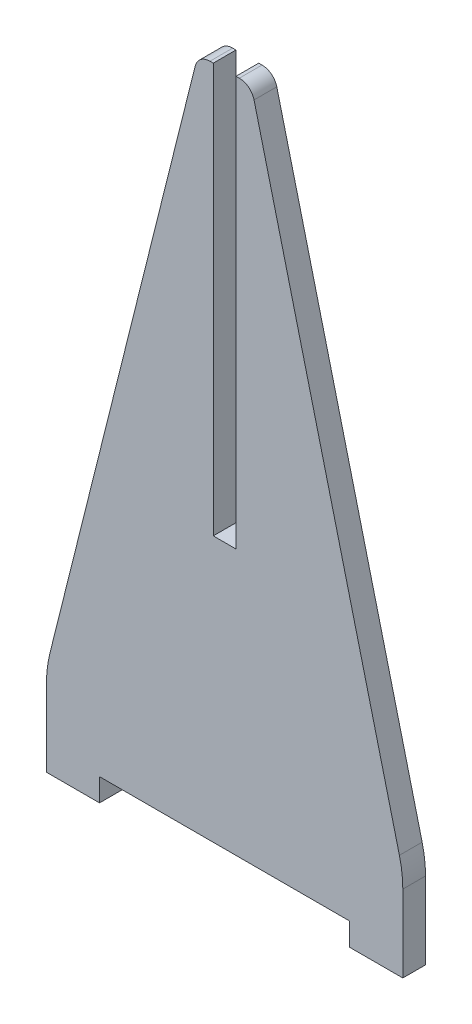
ISO-10303-21;
HEADER;
FILE_DESCRIPTION(('STEP AP214'),'2;1');
FILE_NAME('part.step','',(''),(''),'','','');
FILE_SCHEMA(('AUTOMOTIVE_DESIGN { 1 0 10303 214 1 1 1 1 }'));
ENDSEC;
DATA;
#1=APPLICATION_CONTEXT('core data for automotive mechanical design processes');
#2=APPLICATION_PROTOCOL_DEFINITION('international standard','automotive_design',2000,#1);
#3=PRODUCT_CONTEXT('',#1,'mechanical');
#4=PRODUCT('Part','Part','',(#3));
#5=PRODUCT_RELATED_PRODUCT_CATEGORY('part','',(#4));
#6=PRODUCT_DEFINITION_FORMATION('','',#4);
#7=PRODUCT_DEFINITION_CONTEXT('part definition',#1,'design');
#8=PRODUCT_DEFINITION('design','',#6,#7);
#9=PRODUCT_DEFINITION_SHAPE('','',#8);
#10=(LENGTH_UNIT() NAMED_UNIT(*) SI_UNIT(.MILLI.,.METRE.));
#11=(NAMED_UNIT(*) PLANE_ANGLE_UNIT() SI_UNIT($,.RADIAN.));
#12=(NAMED_UNIT(*) SI_UNIT($,.STERADIAN.) SOLID_ANGLE_UNIT());
#13=UNCERTAINTY_MEASURE_WITH_UNIT(LENGTH_MEASURE(1.E-05),#10,'distance_accuracy_value','');
#14=(GEOMETRIC_REPRESENTATION_CONTEXT(3) GLOBAL_UNCERTAINTY_ASSIGNED_CONTEXT((#13)) GLOBAL_UNIT_ASSIGNED_CONTEXT((#10,
#11,#12)) REPRESENTATION_CONTEXT('',''));
#15=CARTESIAN_POINT('',(0.,0.,0.));
#16=DIRECTION('',(0.,0.,1.));
#17=DIRECTION('',(1.,0.,0.));
#18=AXIS2_PLACEMENT_3D('',#15,#16,#17);
#19=CARTESIAN_POINT('',(23.5,0.,3.));
#20=DIRECTION('',(-1.,0.,0.));
#21=DIRECTION('',(0.,0.,1.));
#22=AXIS2_PLACEMENT_3D('',#19,#20,#21);
#23=PLANE('',#22);
#24=DIRECTION('',(0.,1.,0.));
#25=VECTOR('',#24,1.);
#26=CARTESIAN_POINT('',(23.5,0.,0.));
#27=LINE('',#26,#25);
#28=CARTESIAN_POINT('',(23.5,0.,0.));
#29=VERTEX_POINT('',#28);
#30=CARTESIAN_POINT('',(23.5,10.1534156157351,0.));
#31=VERTEX_POINT('',#30);
#32=EDGE_CURVE('E210',#29,#31,#27,.T.);
#33=ORIENTED_EDGE('',*,*,#32,.T.);
#34=DIRECTION('',(0.,0.,-1.));
#35=VECTOR('',#34,1.);
#36=CARTESIAN_POINT('',(23.5,10.1534156157351,3.));
#37=LINE('',#36,#35);
#38=CARTESIAN_POINT('',(23.5,10.1534156157351,3.));
#39=VERTEX_POINT('',#38);
#40=EDGE_CURVE('E271',#31,#39,#37,.F.);
#41=ORIENTED_EDGE('',*,*,#40,.T.);
#42=DIRECTION('',(0.,1.,0.));
#43=VECTOR('',#42,1.);
#44=CARTESIAN_POINT('',(23.5,0.,3.));
#45=LINE('',#44,#43);
#46=CARTESIAN_POINT('',(23.5,0.,3.));
#47=VERTEX_POINT('',#46);
#48=EDGE_CURVE('E239',#47,#39,#45,.T.);
#49=ORIENTED_EDGE('',*,*,#48,.F.);
#50=DIRECTION('',(0.,0.,-1.));
#51=VECTOR('',#50,1.);
#52=CARTESIAN_POINT('',(23.5,0.,3.));
#53=LINE('',#52,#51);
#54=EDGE_CURVE('E209',#47,#29,#53,.T.);
#55=ORIENTED_EDGE('',*,*,#54,.T.);
#56=EDGE_LOOP('',(#33,#41,#49,#55));
#57=FACE_BOUND('',#56,.T.);
#58=ADVANCED_FACE('F39',(#57),#23,.F.);
#59=CARTESIAN_POINT('',(23.5,12.,3.));
#60=DIRECTION('',(-0.970142500145332,-0.242535625036333,0.));
#61=DIRECTION('',(0.242535625036333,-0.970142500145332,0.));
#62=AXIS2_PLACEMENT_3D('',#59,#60,#61);
#63=PLANE('',#62);
#64=DIRECTION('',(-0.242535625036333,0.970142500145332,0.));
#65=VECTOR('',#64,1.);
#66=CARTESIAN_POINT('',(23.5,12.,0.));
#67=LINE('',#66,#65);
#68=CARTESIAN_POINT('',(23.05213750218,13.7914499912801,0.));
#69=VERTEX_POINT('',#68);
#70=CARTESIAN_POINT('',(3.87873218748184,90.4850712500726,0.));
#71=VERTEX_POINT('',#70);
#72=EDGE_CURVE('E213',#69,#71,#67,.T.);
#73=ORIENTED_EDGE('',*,*,#72,.T.);
#74=DIRECTION('',(0.,0.,-1.));
#75=VECTOR('',#74,1.);
#76=CARTESIAN_POINT('',(3.87873218748183,90.4850712500727,3.));
#77=LINE('',#76,#75);
#78=CARTESIAN_POINT('',(3.87873218748184,90.4850712500726,3.));
#79=VERTEX_POINT('',#78);
#80=EDGE_CURVE('E11',#71,#79,#77,.F.);
#81=ORIENTED_EDGE('',*,*,#80,.T.);
#82=DIRECTION('',(-0.242535625036333,0.970142500145332,0.));
#83=VECTOR('',#82,1.);
#84=CARTESIAN_POINT('',(23.5,12.,3.));
#85=LINE('',#84,#83);
#86=CARTESIAN_POINT('',(23.05213750218,13.7914499912801,3.));
#87=VERTEX_POINT('',#86);
#88=EDGE_CURVE('E171',#87,#79,#85,.T.);
#89=ORIENTED_EDGE('',*,*,#88,.F.);
#90=DIRECTION('',(0.,0.,-1.));
#91=VECTOR('',#90,1.);
#92=CARTESIAN_POINT('',(23.05213750218,13.7914499912801,3.));
#93=LINE('',#92,#91);
#94=EDGE_CURVE('E180',#87,#69,#93,.T.);
#95=ORIENTED_EDGE('',*,*,#94,.T.);
#96=EDGE_LOOP('',(#73,#81,#89,#95));
#97=FACE_BOUND('',#96,.T.);
#98=ADVANCED_FACE('F368',(#97),#63,.F.);
#99=CARTESIAN_POINT('',(1.5,92.,3.));
#100=DIRECTION('',(0.,-1.,0.));
#101=DIRECTION('',(0.,0.,-1.));
#102=AXIS2_PLACEMENT_3D('',#99,#100,#101);
#103=PLANE('',#102);
#104=DIRECTION('',(-1.,0.,0.));
#105=VECTOR('',#104,1.);
#106=CARTESIAN_POINT('',(1.5,92.,3.));
#107=LINE('',#106,#105);
#108=CARTESIAN_POINT('',(1.93844718719117,92.,3.));
#109=VERTEX_POINT('',#108);
#110=CARTESIAN_POINT('',(1.5,92.,3.));
#111=VERTEX_POINT('',#110);
#112=EDGE_CURVE('E161',#109,#111,#107,.T.);
#113=ORIENTED_EDGE('',*,*,#112,.F.);
#114=DIRECTION('',(0.,0.,-1.));
#115=VECTOR('',#114,1.);
#116=CARTESIAN_POINT('',(1.93844718719117,92.,3.));
#117=LINE('',#116,#115);
#118=CARTESIAN_POINT('',(1.93844718719117,92.,0.));
#119=VERTEX_POINT('',#118);
#120=EDGE_CURVE('E47',#109,#119,#117,.T.);
#121=ORIENTED_EDGE('',*,*,#120,.T.);
#122=DIRECTION('',(-1.,0.,0.));
#123=VECTOR('',#122,1.);
#124=CARTESIAN_POINT('',(1.5,92.,0.));
#125=LINE('',#124,#123);
#126=CARTESIAN_POINT('',(1.5,92.,0.));
#127=VERTEX_POINT('',#126);
#128=EDGE_CURVE('E177',#119,#127,#125,.T.);
#129=ORIENTED_EDGE('',*,*,#128,.T.);
#130=DIRECTION('',(0.,0.,-1.));
#131=VECTOR('',#130,1.);
#132=CARTESIAN_POINT('',(1.5,92.,3.));
#133=LINE('',#132,#131);
#134=EDGE_CURVE('E174',#111,#127,#133,.T.);
#135=ORIENTED_EDGE('',*,*,#134,.F.);
#136=EDGE_LOOP('',(#113,#121,#129,#135));
#137=FACE_BOUND('',#136,.T.);
#138=ADVANCED_FACE('F175',(#137),#103,.F.);
#139=CARTESIAN_POINT('',(1.5,38.,3.));
#140=DIRECTION('',(1.,0.,0.));
#141=DIRECTION('',(0.,0.,-1.));
#142=AXIS2_PLACEMENT_3D('',#139,#140,#141);
#143=PLANE('',#142);
#144=DIRECTION('',(0.,-1.,0.));
#145=VECTOR('',#144,1.);
#146=CARTESIAN_POINT('',(1.5,38.,0.));
#147=LINE('',#146,#145);
#148=CARTESIAN_POINT('',(1.5,38.,0.));
#149=VERTEX_POINT('',#148);
#150=EDGE_CURVE('E216',#127,#149,#147,.T.);
#151=ORIENTED_EDGE('',*,*,#150,.T.);
#152=DIRECTION('',(0.,0.,-1.));
#153=VECTOR('',#152,1.);
#154=CARTESIAN_POINT('',(1.5,38.,3.));
#155=LINE('',#154,#153);
#156=CARTESIAN_POINT('',(1.5,38.,3.));
#157=VERTEX_POINT('',#156);
#158=EDGE_CURVE('E181',#157,#149,#155,.T.);
#159=ORIENTED_EDGE('',*,*,#158,.F.);
#160=DIRECTION('',(0.,-1.,0.));
#161=VECTOR('',#160,1.);
#162=CARTESIAN_POINT('',(1.5,38.,3.));
#163=LINE('',#162,#161);
#164=EDGE_CURVE('E166',#111,#157,#163,.T.);
#165=ORIENTED_EDGE('',*,*,#164,.F.);
#166=ORIENTED_EDGE('',*,*,#134,.T.);
#167=EDGE_LOOP('',(#151,#159,#165,#166));
#168=FACE_BOUND('',#167,.T.);
#169=ADVANCED_FACE('F183',(#168),#143,.F.);
#170=CARTESIAN_POINT('',(-1.5,38.,3.));
#171=DIRECTION('',(0.,-1.,0.));
#172=DIRECTION('',(0.,0.,-1.));
#173=AXIS2_PLACEMENT_3D('',#170,#171,#172);
#174=PLANE('',#173);
#175=DIRECTION('',(-1.,0.,0.));
#176=VECTOR('',#175,1.);
#177=CARTESIAN_POINT('',(-1.5,38.,0.));
#178=LINE('',#177,#176);
#179=CARTESIAN_POINT('',(-1.5,38.,0.));
#180=VERTEX_POINT('',#179);
#181=EDGE_CURVE('E218',#149,#180,#178,.T.);
#182=ORIENTED_EDGE('',*,*,#181,.T.);
#183=DIRECTION('',(0.,0.,-1.));
#184=VECTOR('',#183,1.);
#185=CARTESIAN_POINT('',(-1.5,38.,3.));
#186=LINE('',#185,#184);
#187=CARTESIAN_POINT('',(-1.5,38.,3.));
#188=VERTEX_POINT('',#187);
#189=EDGE_CURVE('E260',#188,#180,#186,.T.);
#190=ORIENTED_EDGE('',*,*,#189,.F.);
#191=DIRECTION('',(-1.,0.,0.));
#192=VECTOR('',#191,1.);
#193=CARTESIAN_POINT('',(-1.5,38.,3.));
#194=LINE('',#193,#192);
#195=EDGE_CURVE('E186',#157,#188,#194,.T.);
#196=ORIENTED_EDGE('',*,*,#195,.F.);
#197=ORIENTED_EDGE('',*,*,#158,.T.);
#198=EDGE_LOOP('',(#182,#190,#196,#197));
#199=FACE_BOUND('',#198,.T.);
#200=ADVANCED_FACE('F302',(#199),#174,.F.);
#201=CARTESIAN_POINT('',(-1.5,38.,3.));
#202=DIRECTION('',(-1.,0.,0.));
#203=DIRECTION('',(0.,-1.,0.));
#204=AXIS2_PLACEMENT_3D('',#201,#202,#203);
#205=PLANE('',#204);
#206=DIRECTION('',(0.,1.,0.));
#207=VECTOR('',#206,1.);
#208=CARTESIAN_POINT('',(-1.5,38.,0.));
#209=LINE('',#208,#207);
#210=CARTESIAN_POINT('',(-1.5,92.,0.));
#211=VERTEX_POINT('',#210);
#212=EDGE_CURVE('E220',#180,#211,#209,.T.);
#213=ORIENTED_EDGE('',*,*,#212,.T.);
#214=DIRECTION('',(0.,0.,-1.));
#215=VECTOR('',#214,1.);
#216=CARTESIAN_POINT('',(-1.5,92.,3.));
#217=LINE('',#216,#215);
#218=CARTESIAN_POINT('',(-1.5,92.,3.));
#219=VERTEX_POINT('',#218);
#220=EDGE_CURVE('E257',#219,#211,#217,.T.);
#221=ORIENTED_EDGE('',*,*,#220,.F.);
#222=DIRECTION('',(0.,1.,0.));
#223=VECTOR('',#222,1.);
#224=CARTESIAN_POINT('',(-1.5,38.,3.));
#225=LINE('',#224,#223);
#226=EDGE_CURVE('E188',#188,#219,#225,.T.);
#227=ORIENTED_EDGE('',*,*,#226,.F.);
#228=ORIENTED_EDGE('',*,*,#189,.T.);
#229=EDGE_LOOP('',(#213,#221,#227,#228));
#230=FACE_BOUND('',#229,.T.);
#231=ADVANCED_FACE('F309',(#230),#205,.F.);
#232=CARTESIAN_POINT('',(-3.5,92.,3.));
#233=DIRECTION('',(0.,-1.,0.));
#234=DIRECTION('',(0.,0.,-1.));
#235=AXIS2_PLACEMENT_3D('',#232,#233,#234);
#236=PLANE('',#235);
#237=DIRECTION('',(-1.,0.,0.));
#238=VECTOR('',#237,1.);
#239=CARTESIAN_POINT('',(-3.5,92.,0.));
#240=LINE('',#239,#238);
#241=CARTESIAN_POINT('',(-1.93844718719117,92.,0.));
#242=VERTEX_POINT('',#241);
#243=EDGE_CURVE('E222',#211,#242,#240,.T.);
#244=ORIENTED_EDGE('',*,*,#243,.T.);
#245=DIRECTION('',(0.,0.,-1.));
#246=VECTOR('',#245,1.);
#247=CARTESIAN_POINT('',(-1.93844718719117,92.,3.));
#248=LINE('',#247,#246);
#249=CARTESIAN_POINT('',(-1.93844718719117,92.,3.));
#250=VERTEX_POINT('',#249);
#251=EDGE_CURVE('E290',#242,#250,#248,.F.);
#252=ORIENTED_EDGE('',*,*,#251,.T.);
#253=DIRECTION('',(-1.,0.,0.));
#254=VECTOR('',#253,1.);
#255=CARTESIAN_POINT('',(-3.5,92.,3.));
#256=LINE('',#255,#254);
#257=EDGE_CURVE('E193',#219,#250,#256,.T.);
#258=ORIENTED_EDGE('',*,*,#257,.F.);
#259=ORIENTED_EDGE('',*,*,#220,.T.);
#260=EDGE_LOOP('',(#244,#252,#258,#259));
#261=FACE_BOUND('',#260,.T.);
#262=ADVANCED_FACE('F312',(#261),#236,.F.);
#263=CARTESIAN_POINT('',(-23.5,12.,3.));
#264=DIRECTION('',(0.970142500145332,-0.242535625036333,0.));
#265=DIRECTION('',(0.242535625036333,0.970142500145332,0.));
#266=AXIS2_PLACEMENT_3D('',#263,#264,#265);
#267=PLANE('',#266);
#268=DIRECTION('',(-0.242535625036333,-0.970142500145332,0.));
#269=VECTOR('',#268,1.);
#270=CARTESIAN_POINT('',(-23.5,12.,3.));
#271=LINE('',#270,#269);
#272=CARTESIAN_POINT('',(-3.87873218748184,90.4850712500726,3.));
#273=VERTEX_POINT('',#272);
#274=CARTESIAN_POINT('',(-23.05213750218,13.7914499912801,3.));
#275=VERTEX_POINT('',#274);
#276=EDGE_CURVE('E195',#273,#275,#271,.T.);
#277=ORIENTED_EDGE('',*,*,#276,.F.);
#278=DIRECTION('',(0.,0.,-1.));
#279=VECTOR('',#278,1.);
#280=CARTESIAN_POINT('',(-3.87873218748183,90.4850712500727,3.));
#281=LINE('',#280,#279);
#282=CARTESIAN_POINT('',(-3.87873218748184,90.4850712500726,0.));
#283=VERTEX_POINT('',#282);
#284=EDGE_CURVE('E283',#273,#283,#281,.T.);
#285=ORIENTED_EDGE('',*,*,#284,.T.);
#286=DIRECTION('',(-0.242535625036333,-0.970142500145332,0.));
#287=VECTOR('',#286,1.);
#288=CARTESIAN_POINT('',(-23.5,12.,0.));
#289=LINE('',#288,#287);
#290=CARTESIAN_POINT('',(-23.05213750218,13.7914499912801,0.));
#291=VERTEX_POINT('',#290);
#292=EDGE_CURVE('E225',#283,#291,#289,.T.);
#293=ORIENTED_EDGE('',*,*,#292,.T.);
#294=DIRECTION('',(0.,0.,-1.));
#295=VECTOR('',#294,1.);
#296=CARTESIAN_POINT('',(-23.05213750218,13.7914499912801,3.));
#297=LINE('',#296,#295);
#298=EDGE_CURVE('E280',#291,#275,#297,.F.);
#299=ORIENTED_EDGE('',*,*,#298,.T.);
#300=EDGE_LOOP('',(#277,#285,#293,#299));
#301=FACE_BOUND('',#300,.T.);
#302=ADVANCED_FACE('F319',(#301),#267,.F.);
#303=CARTESIAN_POINT('',(-23.5,0.,3.));
#304=DIRECTION('',(1.,0.,0.));
#305=DIRECTION('',(0.,0.,-1.));
#306=AXIS2_PLACEMENT_3D('',#303,#304,#305);
#307=PLANE('',#306);
#308=DIRECTION('',(0.,-1.,0.));
#309=VECTOR('',#308,1.);
#310=CARTESIAN_POINT('',(-23.5,0.,3.));
#311=LINE('',#310,#309);
#312=CARTESIAN_POINT('',(-23.5,10.1534156157351,3.));
#313=VERTEX_POINT('',#312);
#314=CARTESIAN_POINT('',(-23.5,0.,3.));
#315=VERTEX_POINT('',#314);
#316=EDGE_CURVE('E197',#313,#315,#311,.T.);
#317=ORIENTED_EDGE('',*,*,#316,.F.);
#318=DIRECTION('',(0.,0.,-1.));
#319=VECTOR('',#318,1.);
#320=CARTESIAN_POINT('',(-23.5,10.1534156157351,3.));
#321=LINE('',#320,#319);
#322=CARTESIAN_POINT('',(-23.5,10.1534156157351,0.));
#323=VERTEX_POINT('',#322);
#324=EDGE_CURVE('E277',#313,#323,#321,.T.);
#325=ORIENTED_EDGE('',*,*,#324,.T.);
#326=DIRECTION('',(0.,-1.,0.));
#327=VECTOR('',#326,1.);
#328=CARTESIAN_POINT('',(-23.5,0.,0.));
#329=LINE('',#328,#327);
#330=CARTESIAN_POINT('',(-23.5,0.,0.));
#331=VERTEX_POINT('',#330);
#332=EDGE_CURVE('E227',#323,#331,#329,.T.);
#333=ORIENTED_EDGE('',*,*,#332,.T.);
#334=DIRECTION('',(0.,0.,-1.));
#335=VECTOR('',#334,1.);
#336=CARTESIAN_POINT('',(-23.5,0.,3.));
#337=LINE('',#336,#335);
#338=EDGE_CURVE('E254',#315,#331,#337,.T.);
#339=ORIENTED_EDGE('',*,*,#338,.F.);
#340=EDGE_LOOP('',(#317,#325,#333,#339));
#341=FACE_BOUND('',#340,.T.);
#342=ADVANCED_FACE('F328',(#341),#307,.F.);
#343=CARTESIAN_POINT('',(-23.5,0.,3.));
#344=DIRECTION('',(0.,1.,0.));
#345=DIRECTION('',(0.,0.,1.));
#346=AXIS2_PLACEMENT_3D('',#343,#344,#345);
#347=PLANE('',#346);
#348=DIRECTION('',(1.,0.,0.));
#349=VECTOR('',#348,1.);
#350=CARTESIAN_POINT('',(-23.5,0.,0.));
#351=LINE('',#350,#349);
#352=CARTESIAN_POINT('',(-16.5,0.,0.));
#353=VERTEX_POINT('',#352);
#354=EDGE_CURVE('E229',#331,#353,#351,.T.);
#355=ORIENTED_EDGE('',*,*,#354,.T.);
#356=DIRECTION('',(0.,0.,-1.));
#357=VECTOR('',#356,1.);
#358=CARTESIAN_POINT('',(-16.5,0.,3.));
#359=LINE('',#358,#357);
#360=CARTESIAN_POINT('',(-16.5,0.,3.));
#361=VERTEX_POINT('',#360);
#362=EDGE_CURVE('E251',#361,#353,#359,.T.);
#363=ORIENTED_EDGE('',*,*,#362,.F.);
#364=DIRECTION('',(1.,0.,0.));
#365=VECTOR('',#364,1.);
#366=CARTESIAN_POINT('',(-23.5,0.,3.));
#367=LINE('',#366,#365);
#368=EDGE_CURVE('E199',#315,#361,#367,.T.);
#369=ORIENTED_EDGE('',*,*,#368,.F.);
#370=ORIENTED_EDGE('',*,*,#338,.T.);
#371=EDGE_LOOP('',(#355,#363,#369,#370));
#372=FACE_BOUND('',#371,.T.);
#373=ADVANCED_FACE('F334',(#372),#347,.F.);
#374=CARTESIAN_POINT('',(-16.5,0.,3.));
#375=DIRECTION('',(-1.,0.,0.));
#376=DIRECTION('',(0.,0.,1.));
#377=AXIS2_PLACEMENT_3D('',#374,#375,#376);
#378=PLANE('',#377);
#379=DIRECTION('',(0.,1.,0.));
#380=VECTOR('',#379,1.);
#381=CARTESIAN_POINT('',(-16.5,0.,0.));
#382=LINE('',#381,#380);
#383=CARTESIAN_POINT('',(-16.5,3.,0.));
#384=VERTEX_POINT('',#383);
#385=EDGE_CURVE('E231',#353,#384,#382,.T.);
#386=ORIENTED_EDGE('',*,*,#385,.T.);
#387=DIRECTION('',(0.,0.,-1.));
#388=VECTOR('',#387,1.);
#389=CARTESIAN_POINT('',(-16.5,3.,3.));
#390=LINE('',#389,#388);
#391=CARTESIAN_POINT('',(-16.5,3.,3.));
#392=VERTEX_POINT('',#391);
#393=EDGE_CURVE('E248',#392,#384,#390,.T.);
#394=ORIENTED_EDGE('',*,*,#393,.F.);
#395=DIRECTION('',(0.,1.,0.));
#396=VECTOR('',#395,1.);
#397=CARTESIAN_POINT('',(-16.5,0.,3.));
#398=LINE('',#397,#396);
#399=EDGE_CURVE('E201',#361,#392,#398,.T.);
#400=ORIENTED_EDGE('',*,*,#399,.F.);
#401=ORIENTED_EDGE('',*,*,#362,.T.);
#402=EDGE_LOOP('',(#386,#394,#400,#401));
#403=FACE_BOUND('',#402,.T.);
#404=ADVANCED_FACE('F340',(#403),#378,.F.);
#405=CARTESIAN_POINT('',(-16.5,3.,3.));
#406=DIRECTION('',(0.,1.,0.));
#407=DIRECTION('',(0.,0.,1.));
#408=AXIS2_PLACEMENT_3D('',#405,#406,#407);
#409=PLANE('',#408);
#410=DIRECTION('',(1.,0.,0.));
#411=VECTOR('',#410,1.);
#412=CARTESIAN_POINT('',(-16.5,3.,0.));
#413=LINE('',#412,#411);
#414=CARTESIAN_POINT('',(16.5,3.,0.));
#415=VERTEX_POINT('',#414);
#416=EDGE_CURVE('E233',#384,#415,#413,.T.);
#417=ORIENTED_EDGE('',*,*,#416,.T.);
#418=DIRECTION('',(0.,0.,-1.));
#419=VECTOR('',#418,1.);
#420=CARTESIAN_POINT('',(16.5,3.,3.));
#421=LINE('',#420,#419);
#422=CARTESIAN_POINT('',(16.5,3.,3.));
#423=VERTEX_POINT('',#422);
#424=EDGE_CURVE('E245',#423,#415,#421,.T.);
#425=ORIENTED_EDGE('',*,*,#424,.F.);
#426=DIRECTION('',(1.,0.,0.));
#427=VECTOR('',#426,1.);
#428=CARTESIAN_POINT('',(-16.5,3.,3.));
#429=LINE('',#428,#427);
#430=EDGE_CURVE('E203',#392,#423,#429,.T.);
#431=ORIENTED_EDGE('',*,*,#430,.F.);
#432=ORIENTED_EDGE('',*,*,#393,.T.);
#433=EDGE_LOOP('',(#417,#425,#431,#432));
#434=FACE_BOUND('',#433,.T.);
#435=ADVANCED_FACE('F344',(#434),#409,.F.);
#436=CARTESIAN_POINT('',(16.5,0.,3.));
#437=DIRECTION('',(1.,0.,0.));
#438=DIRECTION('',(0.,0.,-1.));
#439=AXIS2_PLACEMENT_3D('',#436,#437,#438);
#440=PLANE('',#439);
#441=DIRECTION('',(0.,-1.,0.));
#442=VECTOR('',#441,1.);
#443=CARTESIAN_POINT('',(16.5,0.,0.));
#444=LINE('',#443,#442);
#445=CARTESIAN_POINT('',(16.5,0.,0.));
#446=VERTEX_POINT('',#445);
#447=EDGE_CURVE('E235',#415,#446,#444,.T.);
#448=ORIENTED_EDGE('',*,*,#447,.T.);
#449=DIRECTION('',(0.,0.,-1.));
#450=VECTOR('',#449,1.);
#451=CARTESIAN_POINT('',(16.5,0.,3.));
#452=LINE('',#451,#450);
#453=CARTESIAN_POINT('',(16.5,0.,3.));
#454=VERTEX_POINT('',#453);
#455=EDGE_CURVE('E242',#454,#446,#452,.T.);
#456=ORIENTED_EDGE('',*,*,#455,.F.);
#457=DIRECTION('',(0.,-1.,0.));
#458=VECTOR('',#457,1.);
#459=CARTESIAN_POINT('',(16.5,0.,3.));
#460=LINE('',#459,#458);
#461=EDGE_CURVE('E205',#423,#454,#460,.T.);
#462=ORIENTED_EDGE('',*,*,#461,.F.);
#463=ORIENTED_EDGE('',*,*,#424,.T.);
#464=EDGE_LOOP('',(#448,#456,#462,#463));
#465=FACE_BOUND('',#464,.T.);
#466=ADVANCED_FACE('F349',(#465),#440,.F.);
#467=CARTESIAN_POINT('',(23.5,0.,3.));
#468=DIRECTION('',(0.,1.,0.));
#469=DIRECTION('',(0.,0.,1.));
#470=AXIS2_PLACEMENT_3D('',#467,#468,#469);
#471=PLANE('',#470);
#472=DIRECTION('',(1.,0.,0.));
#473=VECTOR('',#472,1.);
#474=CARTESIAN_POINT('',(23.5,0.,0.));
#475=LINE('',#474,#473);
#476=EDGE_CURVE('E237',#446,#29,#475,.T.);
#477=ORIENTED_EDGE('',*,*,#476,.T.);
#478=ORIENTED_EDGE('',*,*,#54,.F.);
#479=DIRECTION('',(1.,0.,0.));
#480=VECTOR('',#479,1.);
#481=CARTESIAN_POINT('',(23.5,0.,3.));
#482=LINE('',#481,#480);
#483=EDGE_CURVE('E207',#454,#47,#482,.T.);
#484=ORIENTED_EDGE('',*,*,#483,.F.);
#485=ORIENTED_EDGE('',*,*,#455,.T.);
#486=EDGE_LOOP('',(#477,#478,#484,#485));
#487=FACE_BOUND('',#486,.T.);
#488=ADVANCED_FACE('F356',(#487),#471,.F.);
#489=CARTESIAN_POINT('',(0.,0.,3.));
#490=DIRECTION('',(0.,0.,-1.));
#491=DIRECTION('',(-1.,0.,0.));
#492=AXIS2_PLACEMENT_3D('',#489,#490,#491);
#493=PLANE('',#492);
#494=ORIENTED_EDGE('',*,*,#257,.T.);
#495=CARTESIAN_POINT('',(-1.93844718719117,90.,3.));
#496=DIRECTION('',(0.,0.,-1.));
#497=DIRECTION('',(-1.,0.,0.));
#498=AXIS2_PLACEMENT_3D('',#495,#496,#497);
#499=CIRCLE('',#498,2.);
#500=EDGE_CURVE('E293',#250,#273,#499,.F.);
#501=ORIENTED_EDGE('',*,*,#500,.T.);
#502=ORIENTED_EDGE('',*,*,#276,.T.);
#503=CARTESIAN_POINT('',(-8.5,10.1534156157351,3.));
#504=DIRECTION('',(0.,0.,-1.));
#505=DIRECTION('',(-1.,0.,0.));
#506=AXIS2_PLACEMENT_3D('',#503,#504,#505);
#507=CIRCLE('',#506,15.);
#508=EDGE_CURVE('E273',#275,#313,#507,.F.);
#509=ORIENTED_EDGE('',*,*,#508,.T.);
#510=ORIENTED_EDGE('',*,*,#316,.T.);
#511=ORIENTED_EDGE('',*,*,#368,.T.);
#512=ORIENTED_EDGE('',*,*,#399,.T.);
#513=ORIENTED_EDGE('',*,*,#430,.T.);
#514=ORIENTED_EDGE('',*,*,#461,.T.);
#515=ORIENTED_EDGE('',*,*,#483,.T.);
#516=ORIENTED_EDGE('',*,*,#48,.T.);
#517=CARTESIAN_POINT('',(8.5,10.1534156157351,3.));
#518=DIRECTION('',(0.,0.,-1.));
#519=DIRECTION('',(-1.,0.,0.));
#520=AXIS2_PLACEMENT_3D('',#517,#518,#519);
#521=CIRCLE('',#520,15.);
#522=EDGE_CURVE('E275',#39,#87,#521,.F.);
#523=ORIENTED_EDGE('',*,*,#522,.T.);
#524=ORIENTED_EDGE('',*,*,#88,.T.);
#525=CARTESIAN_POINT('',(1.93844718719117,90.,3.));
#526=DIRECTION('',(0.,0.,-1.));
#527=DIRECTION('',(-1.,0.,0.));
#528=AXIS2_PLACEMENT_3D('',#525,#526,#527);
#529=CIRCLE('',#528,2.);
#530=EDGE_CURVE('E54',#79,#109,#529,.F.);
#531=ORIENTED_EDGE('',*,*,#530,.T.);
#532=ORIENTED_EDGE('',*,*,#112,.T.);
#533=ORIENTED_EDGE('',*,*,#164,.T.);
#534=ORIENTED_EDGE('',*,*,#195,.T.);
#535=ORIENTED_EDGE('',*,*,#226,.T.);
#536=EDGE_LOOP('',(#494,#501,#502,#509,#510,#511,#512,#513,#514,#515,#516,#523,#524,#531,#532,
#533,#534,#535));
#537=FACE_BOUND('',#536,.T.);
#538=ADVANCED_FACE('F164',(#537),#493,.F.);
#539=CARTESIAN_POINT('',(0.,0.,0.));
#540=DIRECTION('',(0.,0.,-1.));
#541=DIRECTION('',(-1.,0.,0.));
#542=AXIS2_PLACEMENT_3D('',#539,#540,#541);
#543=PLANE('',#542);
#544=ORIENTED_EDGE('',*,*,#292,.F.);
#545=CARTESIAN_POINT('',(-1.93844718719117,90.,0.));
#546=DIRECTION('',(0.,0.,-1.));
#547=DIRECTION('',(-1.,0.,0.));
#548=AXIS2_PLACEMENT_3D('',#545,#546,#547);
#549=CIRCLE('',#548,2.);
#550=EDGE_CURVE('E288',#283,#242,#549,.T.);
#551=ORIENTED_EDGE('',*,*,#550,.T.);
#552=ORIENTED_EDGE('',*,*,#243,.F.);
#553=ORIENTED_EDGE('',*,*,#212,.F.);
#554=ORIENTED_EDGE('',*,*,#181,.F.);
#555=ORIENTED_EDGE('',*,*,#150,.F.);
#556=ORIENTED_EDGE('',*,*,#128,.F.);
#557=CARTESIAN_POINT('',(1.93844718719117,90.,0.));
#558=DIRECTION('',(0.,0.,-1.));
#559=DIRECTION('',(-1.,0.,0.));
#560=AXIS2_PLACEMENT_3D('',#557,#558,#559);
#561=CIRCLE('',#560,2.);
#562=EDGE_CURVE('E286',#119,#71,#561,.T.);
#563=ORIENTED_EDGE('',*,*,#562,.T.);
#564=ORIENTED_EDGE('',*,*,#72,.F.);
#565=CARTESIAN_POINT('',(8.5,10.1534156157351,0.));
#566=DIRECTION('',(0.,0.,-1.));
#567=DIRECTION('',(-1.,0.,0.));
#568=AXIS2_PLACEMENT_3D('',#565,#566,#567);
#569=CIRCLE('',#568,15.);
#570=EDGE_CURVE('E269',#69,#31,#569,.T.);
#571=ORIENTED_EDGE('',*,*,#570,.T.);
#572=ORIENTED_EDGE('',*,*,#32,.F.);
#573=ORIENTED_EDGE('',*,*,#476,.F.);
#574=ORIENTED_EDGE('',*,*,#447,.F.);
#575=ORIENTED_EDGE('',*,*,#416,.F.);
#576=ORIENTED_EDGE('',*,*,#385,.F.);
#577=ORIENTED_EDGE('',*,*,#354,.F.);
#578=ORIENTED_EDGE('',*,*,#332,.F.);
#579=CARTESIAN_POINT('',(-8.5,10.1534156157351,0.));
#580=DIRECTION('',(0.,0.,-1.));
#581=DIRECTION('',(-1.,0.,0.));
#582=AXIS2_PLACEMENT_3D('',#579,#580,#581);
#583=CIRCLE('',#582,15.);
#584=EDGE_CURVE('E266',#323,#291,#583,.T.);
#585=ORIENTED_EDGE('',*,*,#584,.T.);
#586=EDGE_LOOP('',(#544,#551,#552,#553,#554,#555,#556,#563,#564,#571,#572,#573,#574,#575,#576,
#577,#578,#585));
#587=FACE_BOUND('',#586,.T.);
#588=ADVANCED_FACE('F297',(#587),#543,.T.);
#589=CARTESIAN_POINT('',(8.5,10.1534156157351,3.));
#590=DIRECTION('',(0.,0.,-1.));
#591=DIRECTION('',(-1.,0.,0.));
#592=AXIS2_PLACEMENT_3D('',#589,#590,#591);
#593=CYLINDRICAL_SURFACE('',#592,15.);
#594=ORIENTED_EDGE('',*,*,#522,.F.);
#595=ORIENTED_EDGE('',*,*,#40,.F.);
#596=ORIENTED_EDGE('',*,*,#570,.F.);
#597=ORIENTED_EDGE('',*,*,#94,.F.);
#598=EDGE_LOOP('',(#594,#595,#596,#597));
#599=FACE_BOUND('',#598,.T.);
#600=ADVANCED_FACE('F378',(#599),#593,.T.);
#601=CARTESIAN_POINT('',(-8.5,10.1534156157351,3.));
#602=DIRECTION('',(0.,0.,-1.));
#603=DIRECTION('',(-1.,0.,0.));
#604=AXIS2_PLACEMENT_3D('',#601,#602,#603);
#605=CYLINDRICAL_SURFACE('',#604,15.);
#606=ORIENTED_EDGE('',*,*,#508,.F.);
#607=ORIENTED_EDGE('',*,*,#298,.F.);
#608=ORIENTED_EDGE('',*,*,#584,.F.);
#609=ORIENTED_EDGE('',*,*,#324,.F.);
#610=EDGE_LOOP('',(#606,#607,#608,#609));
#611=FACE_BOUND('',#610,.T.);
#612=ADVANCED_FACE('F324',(#611),#605,.T.);
#613=CARTESIAN_POINT('',(-1.93844718719117,90.,3.));
#614=DIRECTION('',(0.,0.,-1.));
#615=DIRECTION('',(-1.,0.,0.));
#616=AXIS2_PLACEMENT_3D('',#613,#614,#615);
#617=CYLINDRICAL_SURFACE('',#616,2.);
#618=ORIENTED_EDGE('',*,*,#500,.F.);
#619=ORIENTED_EDGE('',*,*,#251,.F.);
#620=ORIENTED_EDGE('',*,*,#550,.F.);
#621=ORIENTED_EDGE('',*,*,#284,.F.);
#622=EDGE_LOOP('',(#618,#619,#620,#621));
#623=FACE_BOUND('',#622,.T.);
#624=ADVANCED_FACE('F315',(#623),#617,.T.);
#625=CARTESIAN_POINT('',(1.93844718719117,90.,3.));
#626=DIRECTION('',(0.,0.,-1.));
#627=DIRECTION('',(-1.,0.,0.));
#628=AXIS2_PLACEMENT_3D('',#625,#626,#627);
#629=CYLINDRICAL_SURFACE('',#628,2.);
#630=ORIENTED_EDGE('',*,*,#530,.F.);
#631=ORIENTED_EDGE('',*,*,#80,.F.);
#632=ORIENTED_EDGE('',*,*,#562,.F.);
#633=ORIENTED_EDGE('',*,*,#120,.F.);
#634=EDGE_LOOP('',(#630,#631,#632,#633));
#635=FACE_BOUND('',#634,.T.);
#636=ADVANCED_FACE('F41',(#635),#629,.T.);
#637=CLOSED_SHELL('',(#58,#98,#138,#169,#200,#231,#262,#302,#342,#373,#404,#435,#466,#488,#538,
#588,#600,#612,#624,#636));
#638=MANIFOLD_SOLID_BREP('B2',#637);
#639=ADVANCED_BREP_SHAPE_REPRESENTATION('',(#18,#638),#14);
#640=SHAPE_DEFINITION_REPRESENTATION(#9,#639);
ENDSEC;
END-ISO-10303-21;
